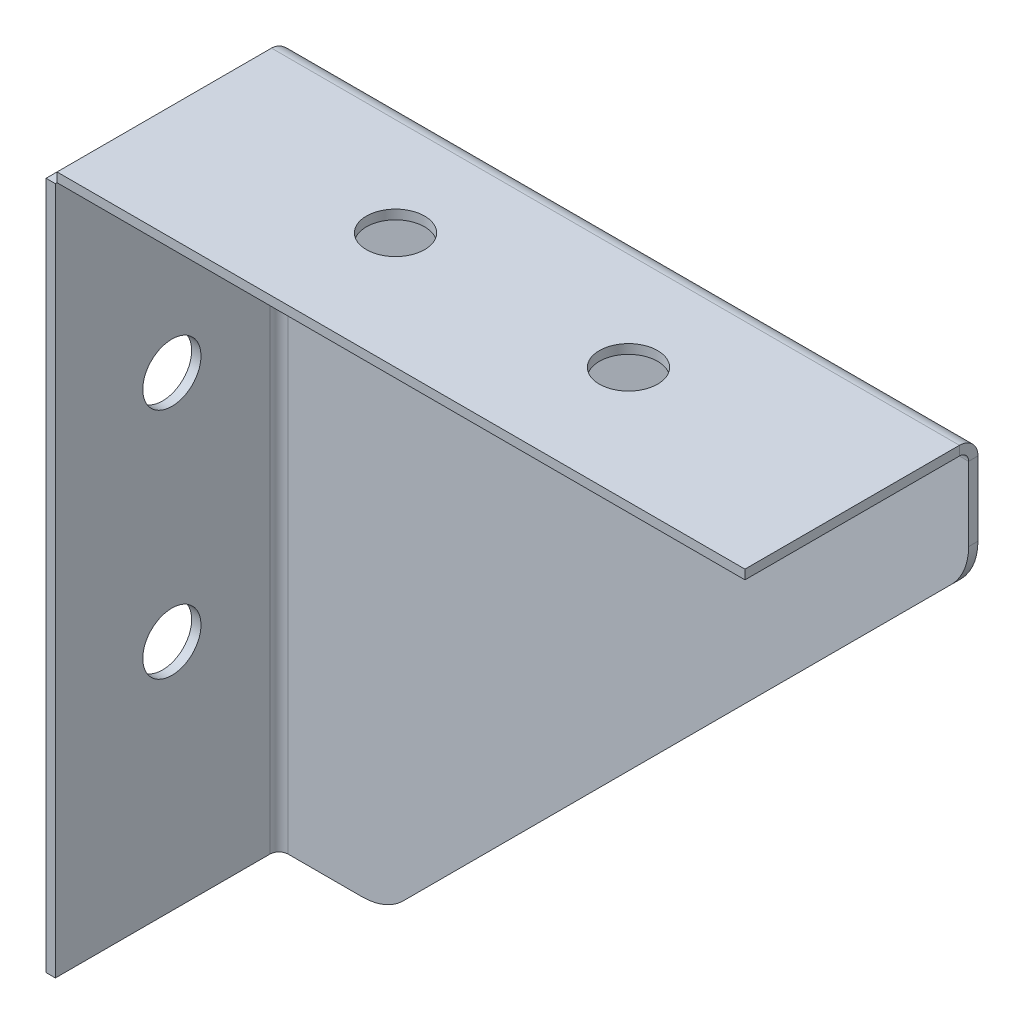
ISO-10303-21;
HEADER;
FILE_DESCRIPTION(('STEP AP214'),'2;1');
FILE_NAME('part.step','',(''),(''),'','','');
FILE_SCHEMA(('AUTOMOTIVE_DESIGN { 1 0 10303 214 1 1 1 1 }'));
ENDSEC;
DATA;
#1=APPLICATION_CONTEXT('core data for automotive mechanical design processes');
#2=APPLICATION_PROTOCOL_DEFINITION('international standard','automotive_design',2000,#1);
#3=PRODUCT_CONTEXT('',#1,'mechanical');
#4=PRODUCT('Part','Part','',(#3));
#5=PRODUCT_RELATED_PRODUCT_CATEGORY('part','',(#4));
#6=PRODUCT_DEFINITION_FORMATION('','',#4);
#7=PRODUCT_DEFINITION_CONTEXT('part definition',#1,'design');
#8=PRODUCT_DEFINITION('design','',#6,#7);
#9=PRODUCT_DEFINITION_SHAPE('','',#8);
#10=(LENGTH_UNIT() NAMED_UNIT(*) SI_UNIT(.MILLI.,.METRE.));
#11=(NAMED_UNIT(*) PLANE_ANGLE_UNIT() SI_UNIT($,.RADIAN.));
#12=(NAMED_UNIT(*) SI_UNIT($,.STERADIAN.) SOLID_ANGLE_UNIT());
#13=UNCERTAINTY_MEASURE_WITH_UNIT(LENGTH_MEASURE(1.E-05),#10,'distance_accuracy_value','');
#14=(GEOMETRIC_REPRESENTATION_CONTEXT(3) GLOBAL_UNCERTAINTY_ASSIGNED_CONTEXT((#13)) GLOBAL_UNIT_ASSIGNED_CONTEXT((#10,
#11,#12)) REPRESENTATION_CONTEXT('',''));
#15=CARTESIAN_POINT('',(0.,0.,0.));
#16=DIRECTION('',(0.,0.,1.));
#17=DIRECTION('',(1.,0.,0.));
#18=AXIS2_PLACEMENT_3D('',#15,#16,#17);
#19=CARTESIAN_POINT('',(12.7,-76.2,1.016));
#20=DIRECTION('',(0.,1.,0.));
#21=DIRECTION('',(0.,0.,1.));
#22=AXIS2_PLACEMENT_3D('',#19,#20,#21);
#23=PLANE('',#22);
#24=DIRECTION('',(1.,0.,0.));
#25=VECTOR('',#24,1.);
#26=CARTESIAN_POINT('',(12.7,-76.2,0.));
#27=LINE('',#26,#25);
#28=CARTESIAN_POINT('',(2.01599999999893,-76.1999999999716,0.));
#29=VERTEX_POINT('',#28);
#30=CARTESIAN_POINT('',(10.0697438789309,-76.2,0.));
#31=VERTEX_POINT('',#30);
#32=EDGE_CURVE('E272',#29,#31,#27,.T.);
#33=ORIENTED_EDGE('',*,*,#32,.T.);
#34=DIRECTION('',(0.,0.,-1.));
#35=VECTOR('',#34,1.);
#36=CARTESIAN_POINT('',(10.0697438789309,-76.2,1.016));
#37=LINE('',#36,#35);
#38=CARTESIAN_POINT('',(10.0697438789309,-76.2,1.016));
#39=VERTEX_POINT('',#38);
#40=EDGE_CURVE('E65',#31,#39,#37,.F.);
#41=ORIENTED_EDGE('',*,*,#40,.T.);
#42=DIRECTION('',(1.,0.,0.));
#43=VECTOR('',#42,1.);
#44=CARTESIAN_POINT('',(12.7,-76.2,1.016));
#45=LINE('',#44,#43);
#46=CARTESIAN_POINT('',(2.01599999999893,-76.1999999999716,1.016));
#47=VERTEX_POINT('',#46);
#48=EDGE_CURVE('E275',#47,#39,#45,.T.);
#49=ORIENTED_EDGE('',*,*,#48,.F.);
#50=DIRECTION('',(0.,0.,-1.));
#51=VECTOR('',#50,1.);
#52=CARTESIAN_POINT('',(2.01599999999893,-76.1999999999716,0.));
#53=LINE('',#52,#51);
#54=EDGE_CURVE('E202',#29,#47,#53,.F.);
#55=ORIENTED_EDGE('',*,*,#54,.F.);
#56=EDGE_LOOP('',(#33,#41,#49,#55));
#57=FACE_BOUND('',#56,.T.);
#58=ADVANCED_FACE('F41',(#57),#23,.F.);
#59=CARTESIAN_POINT('',(76.2,-12.7,1.016));
#60=DIRECTION('',(-0.707106781186548,0.707106781186548,0.));
#61=DIRECTION('',(-0.707106781186548,-0.707106781186548,0.));
#62=AXIS2_PLACEMENT_3D('',#59,#60,#61);
#63=PLANE('',#62);
#64=DIRECTION('',(0.707106781186548,0.707106781186548,0.));
#65=VECTOR('',#64,1.);
#66=CARTESIAN_POINT('',(76.2,-12.7,1.016));
#67=LINE('',#66,#65);
#68=CARTESIAN_POINT('',(14.5598719394654,-74.3401280605346,1.016));
#69=VERTEX_POINT('',#68);
#70=CARTESIAN_POINT('',(74.3401280605346,-14.5598719394654,1.016));
#71=VERTEX_POINT('',#70);
#72=EDGE_CURVE('E277',#69,#71,#67,.T.);
#73=ORIENTED_EDGE('',*,*,#72,.F.);
#74=DIRECTION('',(0.,0.,-1.));
#75=VECTOR('',#74,1.);
#76=CARTESIAN_POINT('',(14.5598719394654,-74.3401280605346,1.016));
#77=LINE('',#76,#75);
#78=CARTESIAN_POINT('',(14.5598719394654,-74.3401280605346,0.));
#79=VERTEX_POINT('',#78);
#80=EDGE_CURVE('E289',#69,#79,#77,.T.);
#81=ORIENTED_EDGE('',*,*,#80,.T.);
#82=DIRECTION('',(0.707106781186548,0.707106781186548,0.));
#83=VECTOR('',#82,1.);
#84=CARTESIAN_POINT('',(76.2,-12.7,0.));
#85=LINE('',#84,#83);
#86=CARTESIAN_POINT('',(74.3401280605346,-14.5598719394654,0.));
#87=VERTEX_POINT('',#86);
#88=EDGE_CURVE('E284',#79,#87,#85,.T.);
#89=ORIENTED_EDGE('',*,*,#88,.T.);
#90=DIRECTION('',(0.,0.,-1.));
#91=VECTOR('',#90,1.);
#92=CARTESIAN_POINT('',(74.3401280605346,-14.5598719394654,1.016));
#93=LINE('',#92,#91);
#94=EDGE_CURVE('E282',#87,#71,#93,.F.);
#95=ORIENTED_EDGE('',*,*,#94,.T.);
#96=EDGE_LOOP('',(#73,#81,#89,#95));
#97=FACE_BOUND('',#96,.T.);
#98=ADVANCED_FACE('F304',(#97),#63,.F.);
#99=CARTESIAN_POINT('',(76.2,0.,1.016));
#100=DIRECTION('',(-1.,0.,0.));
#101=DIRECTION('',(0.,0.,1.));
#102=AXIS2_PLACEMENT_3D('',#99,#100,#101);
#103=PLANE('',#102);
#104=DIRECTION('',(0.,1.,0.));
#105=VECTOR('',#104,1.);
#106=CARTESIAN_POINT('',(76.2,0.,1.016));
#107=LINE('',#106,#105);
#108=CARTESIAN_POINT('',(76.2,-10.0697438789308,1.016));
#109=VERTEX_POINT('',#108);
#110=CARTESIAN_POINT('',(76.2,-2.016,1.016));
#111=VERTEX_POINT('',#110);
#112=EDGE_CURVE('E280',#109,#111,#107,.T.);
#113=ORIENTED_EDGE('',*,*,#112,.F.);
#114=DIRECTION('',(0.,0.,-1.));
#115=VECTOR('',#114,1.);
#116=CARTESIAN_POINT('',(76.2,-10.0697438789308,1.016));
#117=LINE('',#116,#115);
#118=CARTESIAN_POINT('',(76.2,-10.0697438789308,0.));
#119=VERTEX_POINT('',#118);
#120=EDGE_CURVE('E11',#109,#119,#117,.T.);
#121=ORIENTED_EDGE('',*,*,#120,.T.);
#122=DIRECTION('',(0.,1.,0.));
#123=VECTOR('',#122,1.);
#124=CARTESIAN_POINT('',(76.2,0.,0.));
#125=LINE('',#124,#123);
#126=CARTESIAN_POINT('',(76.2,-2.016,0.));
#127=VERTEX_POINT('',#126);
#128=EDGE_CURVE('E278',#119,#127,#125,.T.);
#129=ORIENTED_EDGE('',*,*,#128,.T.);
#130=DIRECTION('',(0.,0.,-1.));
#131=VECTOR('',#130,1.);
#132=CARTESIAN_POINT('',(76.1999999999716,-2.016,0.));
#133=LINE('',#132,#131);
#134=EDGE_CURVE('E235',#127,#111,#133,.F.);
#135=ORIENTED_EDGE('',*,*,#134,.T.);
#136=EDGE_LOOP('',(#113,#121,#129,#135));
#137=FACE_BOUND('',#136,.T.);
#138=ADVANCED_FACE('F343',(#137),#103,.F.);
#139=CARTESIAN_POINT('',(0.,0.,1.016));
#140=DIRECTION('',(0.,0.,-1.));
#141=DIRECTION('',(-1.,0.,0.));
#142=AXIS2_PLACEMENT_3D('',#139,#140,#141);
#143=PLANE('',#142);
#144=ORIENTED_EDGE('',*,*,#48,.T.);
#145=CARTESIAN_POINT('',(10.0697438789309,-69.85,1.016));
#146=DIRECTION('',(0.,0.,-1.));
#147=DIRECTION('',(-1.,0.,0.));
#148=AXIS2_PLACEMENT_3D('',#145,#146,#147);
#149=CIRCLE('',#148,6.35);
#150=EDGE_CURVE('E50',#39,#69,#149,.F.);
#151=ORIENTED_EDGE('',*,*,#150,.T.);
#152=ORIENTED_EDGE('',*,*,#72,.T.);
#153=CARTESIAN_POINT('',(69.85,-10.0697438789308,1.016));
#154=DIRECTION('',(0.,0.,-1.));
#155=DIRECTION('',(-1.,0.,0.));
#156=AXIS2_PLACEMENT_3D('',#153,#154,#155);
#157=CIRCLE('',#156,6.35);
#158=EDGE_CURVE('E57',#71,#109,#157,.F.);
#159=ORIENTED_EDGE('',*,*,#158,.T.);
#160=ORIENTED_EDGE('',*,*,#112,.T.);
#161=DIRECTION('',(-1.,0.,0.));
#162=VECTOR('',#161,1.);
#163=CARTESIAN_POINT('',(457.2,-2.016,1.016));
#164=LINE('',#163,#162);
#165=CARTESIAN_POINT('',(2.016,-2.016,1.016));
#166=VERTEX_POINT('',#165);
#167=EDGE_CURVE('E218',#111,#166,#164,.T.);
#168=ORIENTED_EDGE('',*,*,#167,.T.);
#169=DIRECTION('',(0.,-1.,0.));
#170=VECTOR('',#169,1.);
#171=CARTESIAN_POINT('',(2.016,0.,1.016));
#172=LINE('',#171,#170);
#173=EDGE_CURVE('E205',#166,#47,#172,.T.);
#174=ORIENTED_EDGE('',*,*,#173,.T.);
#175=EDGE_LOOP('',(#144,#151,#152,#159,#160,#168,#174));
#176=FACE_BOUND('',#175,.T.);
#177=ADVANCED_FACE('F300',(#176),#143,.F.);
#178=CARTESIAN_POINT('',(0.,0.,0.));
#179=DIRECTION('',(0.,0.,-1.));
#180=DIRECTION('',(-1.,0.,0.));
#181=AXIS2_PLACEMENT_3D('',#178,#179,#180);
#182=PLANE('',#181);
#183=ORIENTED_EDGE('',*,*,#88,.F.);
#184=CARTESIAN_POINT('',(10.0697438789309,-69.85,0.));
#185=DIRECTION('',(0.,0.,-1.));
#186=DIRECTION('',(-1.,0.,0.));
#187=AXIS2_PLACEMENT_3D('',#184,#185,#186);
#188=CIRCLE('',#187,6.35);
#189=EDGE_CURVE('E294',#79,#31,#188,.T.);
#190=ORIENTED_EDGE('',*,*,#189,.T.);
#191=ORIENTED_EDGE('',*,*,#32,.F.);
#192=DIRECTION('',(0.,-1.,0.));
#193=VECTOR('',#192,1.);
#194=CARTESIAN_POINT('',(2.016,0.,0.));
#195=LINE('',#194,#193);
#196=CARTESIAN_POINT('',(2.01599999999997,-2.01599999998326,0.));
#197=VERTEX_POINT('',#196);
#198=EDGE_CURVE('E197',#197,#29,#195,.T.);
#199=ORIENTED_EDGE('',*,*,#198,.F.);
#200=DIRECTION('',(-1.,0.,0.));
#201=VECTOR('',#200,1.);
#202=CARTESIAN_POINT('',(457.2,-2.016,0.));
#203=LINE('',#202,#201);
#204=EDGE_CURVE('E211',#127,#197,#203,.T.);
#205=ORIENTED_EDGE('',*,*,#204,.F.);
#206=ORIENTED_EDGE('',*,*,#128,.F.);
#207=CARTESIAN_POINT('',(69.85,-10.0697438789308,0.));
#208=DIRECTION('',(0.,0.,-1.));
#209=DIRECTION('',(-1.,0.,0.));
#210=AXIS2_PLACEMENT_3D('',#207,#208,#209);
#211=CIRCLE('',#210,6.35);
#212=EDGE_CURVE('E292',#119,#87,#211,.T.);
#213=ORIENTED_EDGE('',*,*,#212,.T.);
#214=EDGE_LOOP('',(#183,#190,#191,#199,#205,#206,#213));
#215=FACE_BOUND('',#214,.T.);
#216=ADVANCED_FACE('F310',(#215),#182,.T.);
#217=CARTESIAN_POINT('',(76.2,0.,25.4));
#218=DIRECTION('',(0.,0.,1.));
#219=DIRECTION('',(1.,0.,0.));
#220=AXIS2_PLACEMENT_3D('',#217,#218,#219);
#221=PLANE('',#220);
#222=DIRECTION('',(0.,1.,0.));
#223=VECTOR('',#222,1.);
#224=CARTESIAN_POINT('',(1.19560512240656,0.,25.4));
#225=LINE('',#224,#223);
#226=CARTESIAN_POINT('',(1.19560512240656,0.,25.4));
#227=VERTEX_POINT('',#226);
#228=CARTESIAN_POINT('',(1.19560512240656,-1.016,25.4));
#229=VERTEX_POINT('',#228);
#230=EDGE_CURVE('E269',#227,#229,#225,.F.);
#231=ORIENTED_EDGE('',*,*,#230,.T.);
#232=DIRECTION('',(1.,0.,0.));
#233=VECTOR('',#232,1.);
#234=CARTESIAN_POINT('',(76.2,-1.016,25.4));
#235=LINE('',#234,#233);
#236=CARTESIAN_POINT('',(76.2,-1.016,25.4));
#237=VERTEX_POINT('',#236);
#238=EDGE_CURVE('E248',#237,#229,#235,.F.);
#239=ORIENTED_EDGE('',*,*,#238,.F.);
#240=DIRECTION('',(0.,1.,0.));
#241=VECTOR('',#240,1.);
#242=CARTESIAN_POINT('',(76.2,0.,25.4));
#243=LINE('',#242,#241);
#244=CARTESIAN_POINT('',(76.2,0.,25.4));
#245=VERTEX_POINT('',#244);
#246=EDGE_CURVE('E266',#245,#237,#243,.F.);
#247=ORIENTED_EDGE('',*,*,#246,.F.);
#248=DIRECTION('',(1.,0.,0.));
#249=VECTOR('',#248,1.);
#250=CARTESIAN_POINT('',(76.2,0.,25.4));
#251=LINE('',#250,#249);
#252=EDGE_CURVE('E238',#245,#227,#251,.F.);
#253=ORIENTED_EDGE('',*,*,#252,.T.);
#254=EDGE_LOOP('',(#231,#239,#247,#253));
#255=FACE_BOUND('',#254,.T.);
#256=ADVANCED_FACE('F363',(#255),#221,.T.);
#257=CARTESIAN_POINT('',(76.2,0.,25.4));
#258=DIRECTION('',(-1.,0.,0.));
#259=DIRECTION('',(0.,0.,1.));
#260=AXIS2_PLACEMENT_3D('',#257,#258,#259);
#261=PLANE('',#260);
#262=ORIENTED_EDGE('',*,*,#246,.T.);
#263=DIRECTION('',(0.,0.,1.));
#264=VECTOR('',#263,1.);
#265=CARTESIAN_POINT('',(76.2,-1.016,25.4));
#266=LINE('',#265,#264);
#267=CARTESIAN_POINT('',(76.1999999999716,-1.016,2.016));
#268=VERTEX_POINT('',#267);
#269=EDGE_CURVE('E245',#237,#268,#266,.F.);
#270=ORIENTED_EDGE('',*,*,#269,.T.);
#271=DIRECTION('',(0.,1.,0.));
#272=VECTOR('',#271,1.);
#273=CARTESIAN_POINT('',(76.2,0.,2.016));
#274=LINE('',#273,#272);
#275=CARTESIAN_POINT('',(76.1999999999716,0.,2.016));
#276=VERTEX_POINT('',#275);
#277=EDGE_CURVE('E263',#276,#268,#274,.F.);
#278=ORIENTED_EDGE('',*,*,#277,.F.);
#279=DIRECTION('',(0.,0.,1.));
#280=VECTOR('',#279,1.);
#281=CARTESIAN_POINT('',(76.2,0.,25.4));
#282=LINE('',#281,#280);
#283=EDGE_CURVE('E257',#245,#276,#282,.F.);
#284=ORIENTED_EDGE('',*,*,#283,.F.);
#285=EDGE_LOOP('',(#262,#270,#278,#284));
#286=FACE_BOUND('',#285,.T.);
#287=ADVANCED_FACE('F361',(#286),#261,.F.);
#288=CARTESIAN_POINT('',(1.19560512240656,0.,25.4));
#289=DIRECTION('',(-1.,0.,0.));
#290=DIRECTION('',(0.,0.,1.));
#291=AXIS2_PLACEMENT_3D('',#288,#289,#290);
#292=PLANE('',#291);
#293=DIRECTION('',(0.,0.,1.));
#294=VECTOR('',#293,1.);
#295=CARTESIAN_POINT('',(1.19560512240656,0.,25.4));
#296=LINE('',#295,#294);
#297=CARTESIAN_POINT('',(1.19560512240656,0.,2.016));
#298=VERTEX_POINT('',#297);
#299=EDGE_CURVE('E251',#298,#227,#296,.T.);
#300=ORIENTED_EDGE('',*,*,#299,.F.);
#301=DIRECTION('',(0.,1.,0.));
#302=VECTOR('',#301,1.);
#303=CARTESIAN_POINT('',(1.19560512240656,0.,2.016));
#304=LINE('',#303,#302);
#305=CARTESIAN_POINT('',(1.19560512240469,-1.016,2.016));
#306=VERTEX_POINT('',#305);
#307=EDGE_CURVE('E253',#298,#306,#304,.F.);
#308=ORIENTED_EDGE('',*,*,#307,.T.);
#309=DIRECTION('',(0.,0.,1.));
#310=VECTOR('',#309,1.);
#311=CARTESIAN_POINT('',(1.19560512240656,-1.016,25.4));
#312=LINE('',#311,#310);
#313=EDGE_CURVE('E244',#306,#229,#312,.T.);
#314=ORIENTED_EDGE('',*,*,#313,.T.);
#315=ORIENTED_EDGE('',*,*,#230,.F.);
#316=EDGE_LOOP('',(#300,#308,#314,#315));
#317=FACE_BOUND('',#316,.T.);
#318=ADVANCED_FACE('F354',(#317),#292,.T.);
#319=CARTESIAN_POINT('',(76.2,-1.016,25.4));
#320=DIRECTION('',(0.,1.,0.));
#321=DIRECTION('',(0.,0.,1.));
#322=AXIS2_PLACEMENT_3D('',#319,#320,#321);
#323=PLANE('',#322);
#324=CARTESIAN_POINT('',(25.3999999999946,-1.016,12.7));
#325=DIRECTION('',(0.,1.,0.));
#326=DIRECTION('',(0.,0.,1.));
#327=AXIS2_PLACEMENT_3D('',#324,#325,#326);
#328=CIRCLE('',#327,3.17499999999999);
#329=CARTESIAN_POINT('',(25.3999999999946,-1.016,15.875));
#330=VERTEX_POINT('',#329);
#331=EDGE_CURVE('E45',#330,#330,#328,.T.);
#332=ORIENTED_EDGE('',*,*,#331,.T.);
#333=EDGE_LOOP('',(#332));
#334=FACE_BOUND('',#333,.T.);
#335=CARTESIAN_POINT('',(50.8000000000088,-1.016,12.7));
#336=DIRECTION('',(0.,1.,0.));
#337=DIRECTION('',(0.,0.,1.));
#338=AXIS2_PLACEMENT_3D('',#335,#336,#337);
#339=CIRCLE('',#338,3.17499999999999);
#340=CARTESIAN_POINT('',(50.8000000000088,-1.016,15.875));
#341=VERTEX_POINT('',#340);
#342=EDGE_CURVE('E183',#341,#341,#339,.T.);
#343=ORIENTED_EDGE('',*,*,#342,.T.);
#344=EDGE_LOOP('',(#343));
#345=FACE_BOUND('',#344,.T.);
#346=DIRECTION('',(1.,0.,0.));
#347=VECTOR('',#346,1.);
#348=CARTESIAN_POINT('',(76.2,-1.016,2.016));
#349=LINE('',#348,#347);
#350=EDGE_CURVE('E241',#268,#306,#349,.F.);
#351=ORIENTED_EDGE('',*,*,#350,.F.);
#352=ORIENTED_EDGE('',*,*,#269,.F.);
#353=ORIENTED_EDGE('',*,*,#238,.T.);
#354=ORIENTED_EDGE('',*,*,#313,.F.);
#355=EDGE_LOOP('',(#351,#352,#353,#354));
#356=FACE_BOUND('',#355,.T.);
#357=ADVANCED_FACE('F350',(#334,#345,#356),#323,.F.);
#358=CARTESIAN_POINT('',(76.2,0.,25.4));
#359=DIRECTION('',(0.,1.,0.));
#360=DIRECTION('',(0.,0.,1.));
#361=AXIS2_PLACEMENT_3D('',#358,#359,#360);
#362=PLANE('',#361);
#363=CARTESIAN_POINT('',(25.3999999999946,0.,12.7));
#364=DIRECTION('',(0.,1.,0.));
#365=DIRECTION('',(0.,0.,1.));
#366=AXIS2_PLACEMENT_3D('',#363,#364,#365);
#367=CIRCLE('',#366,3.17499999999999);
#368=CARTESIAN_POINT('',(25.3999999999946,0.,15.875));
#369=VERTEX_POINT('',#368);
#370=EDGE_CURVE('E424',#369,#369,#367,.T.);
#371=ORIENTED_EDGE('',*,*,#370,.F.);
#372=EDGE_LOOP('',(#371));
#373=FACE_BOUND('',#372,.T.);
#374=CARTESIAN_POINT('',(50.8000000000088,0.,12.7));
#375=DIRECTION('',(0.,1.,0.));
#376=DIRECTION('',(0.,0.,1.));
#377=AXIS2_PLACEMENT_3D('',#374,#375,#376);
#378=CIRCLE('',#377,3.17499999999999);
#379=CARTESIAN_POINT('',(50.8000000000088,0.,15.875));
#380=VERTEX_POINT('',#379);
#381=EDGE_CURVE('E427',#380,#380,#378,.T.);
#382=ORIENTED_EDGE('',*,*,#381,.F.);
#383=EDGE_LOOP('',(#382));
#384=FACE_BOUND('',#383,.T.);
#385=DIRECTION('',(1.,0.,0.));
#386=VECTOR('',#385,1.);
#387=CARTESIAN_POINT('',(76.2,0.,2.016));
#388=LINE('',#387,#386);
#389=EDGE_CURVE('E254',#276,#298,#388,.F.);
#390=ORIENTED_EDGE('',*,*,#389,.T.);
#391=ORIENTED_EDGE('',*,*,#299,.T.);
#392=ORIENTED_EDGE('',*,*,#252,.F.);
#393=ORIENTED_EDGE('',*,*,#283,.T.);
#394=EDGE_LOOP('',(#390,#391,#392,#393));
#395=FACE_BOUND('',#394,.T.);
#396=ADVANCED_FACE('F357',(#373,#384,#395),#362,.T.);
#397=CARTESIAN_POINT('',(76.1999999999716,-2.016,2.016));
#398=DIRECTION('',(-1.,1.40773503964908E-11,0.));
#399=DIRECTION('',(-1.40773503964908E-11,-1.,0.));
#400=AXIS2_PLACEMENT_3D('',#397,#398,#399);
#401=PLANE('',#400);
#402=ORIENTED_EDGE('',*,*,#277,.T.);
#403=CARTESIAN_POINT('',(76.1999999999716,-2.016,2.016));
#404=DIRECTION('',(1.,-1.40773503964908E-11,0.));
#405=DIRECTION('',(1.40773503964908E-11,1.,0.));
#406=AXIS2_PLACEMENT_3D('',#403,#404,#405);
#407=CIRCLE('',#406,1.);
#408=EDGE_CURVE('E221',#268,#111,#407,.F.);
#409=ORIENTED_EDGE('',*,*,#408,.T.);
#410=ORIENTED_EDGE('',*,*,#134,.F.);
#411=CARTESIAN_POINT('',(76.1999999999716,-2.016,2.016));
#412=DIRECTION('',(1.,-1.40773503964908E-11,0.));
#413=DIRECTION('',(1.40773503964908E-11,1.,0.));
#414=AXIS2_PLACEMENT_3D('',#411,#412,#413);
#415=CIRCLE('',#414,2.016);
#416=EDGE_CURVE('E230',#276,#127,#415,.F.);
#417=ORIENTED_EDGE('',*,*,#416,.F.);
#418=EDGE_LOOP('',(#402,#409,#410,#417));
#419=FACE_BOUND('',#418,.T.);
#420=ADVANCED_FACE('F341',(#419),#401,.F.);
#421=CARTESIAN_POINT('',(1.19560512240469,0.,2.016));
#422=CARTESIAN_POINT('',(1.19560512240469,-0.338666666666667,2.016));
#423=CARTESIAN_POINT('',(1.19560512240469,-0.677333333333333,2.016));
#424=CARTESIAN_POINT('',(1.19560512240469,-1.016,2.016));
#425=CARTESIAN_POINT('',(1.19560512240469,0.,6.048));
#426=CARTESIAN_POINT('',(1.19560512240469,-0.338666666666667,5.37066666666667));
#427=CARTESIAN_POINT('',(1.19560512240469,-0.677333333333333,4.69333333333334));
#428=CARTESIAN_POINT('',(1.19560512240469,-1.016,4.016));
#429=CARTESIAN_POINT('',(2.83639487759157,-4.032,6.048));
#430=CARTESIAN_POINT('',(2.83639487759157,-3.69333333333334,5.37066666666667));
#431=CARTESIAN_POINT('',(2.83639487759157,-3.35466666666667,4.69333333333334));
#432=CARTESIAN_POINT('',(2.83639487759157,-3.016,4.016));
#433=CARTESIAN_POINT('',(2.83639487759157,-4.032,2.016));
#434=CARTESIAN_POINT('',(2.83639487759157,-3.69333333333333,2.016));
#435=CARTESIAN_POINT('',(2.83639487759157,-3.35466666666667,2.016));
#436=CARTESIAN_POINT('',(2.83639487759157,-3.016,2.016));
#437=CARTESIAN_POINT('',(2.83639487759157,-4.032,-2.016));
#438=CARTESIAN_POINT('',(2.83639487759157,-3.69333333333333,-1.33866666666667));
#439=CARTESIAN_POINT('',(2.83639487759157,-3.35466666666667,-0.661333333333333));
#440=CARTESIAN_POINT('',(2.83639487759157,-3.016,0.0160000000000008));
#441=CARTESIAN_POINT('',(1.19560512240469,0.,-2.016));
#442=CARTESIAN_POINT('',(1.19560512240469,-0.338666666666667,-1.33866666666667));
#443=CARTESIAN_POINT('',(1.19560512240469,-0.677333333333333,-0.661333333333333));
#444=CARTESIAN_POINT('',(1.19560512240469,-1.016,0.0160000000000008));
#445=CARTESIAN_POINT('',(1.19560512240469,0.,2.016));
#446=CARTESIAN_POINT('',(1.19560512240469,-0.338666666666667,2.016));
#447=CARTESIAN_POINT('',(1.19560512240469,-0.677333333333333,2.016));
#448=CARTESIAN_POINT('',(1.19560512240469,-1.016,2.016));
#449=(BOUNDED_SURFACE() B_SPLINE_SURFACE(3,3,((#421,#422,#423,#424),(#425,#426,#427,#428),(#429,
#430,#431,#432),(#433,#434,#435,#436),(#437,#438,#439,#440),(#441,#442,#443,#444),(#445,#446,
#447,#448)),.UNSPECIFIED.,.T.,.F.,.F.) B_SPLINE_SURFACE_WITH_KNOTS((4,3,4),(4,4),(0.,0.5,1.),
(0.,1.),.UNSPECIFIED.) GEOMETRIC_REPRESENTATION_ITEM() RATIONAL_B_SPLINE_SURFACE(((1.,1.,1.,1.),
(0.333333333333333,0.333333333333333,0.333333333333333,0.333333333333333),(0.333333333333333,
0.333333333333333,0.333333333333333,0.333333333333333),(1.,1.,1.,1.),(0.333333333333333,
0.333333333333333,0.333333333333333,0.333333333333333),(0.333333333333333,0.333333333333333,
0.333333333333333,0.333333333333333),(1.,1.,1.,1.))) REPRESENTATION_ITEM('') SURFACE());
#450=CARTESIAN_POINT('',(2.01599999999813,-2.016,2.016));
#451=DIRECTION('',(-0.92624294168685,-0.376927065856633,0.));
#452=DIRECTION('',(-0.376927065856633,0.92624294168685,0.));
#453=AXIS2_PLACEMENT_3D('',#450,#451,#452);
#454=ELLIPSE('',#453,2.1765348044958,2.016);
#455=EDGE_CURVE('E222',#197,#298,#454,.F.);
#456=DIRECTION('',(0.,0.,-1.));
#457=VECTOR('',#456,1.);
#458=CARTESIAN_POINT('',(2.01599999999813,-2.016,0.));
#459=LINE('',#458,#457);
#460=EDGE_CURVE('E227',#197,#166,#459,.F.);
#461=CARTESIAN_POINT('',(2.01599999999813,-2.016,2.016));
#462=DIRECTION('',(-0.773118082662841,-0.634262114791458,0.));
#463=DIRECTION('',(-0.634262114791458,0.773118082662841,0.));
#464=AXIS2_PLACEMENT_3D('',#461,#462,#463);
#465=ELLIPSE('',#464,1.29346347268934,1.);
#466=EDGE_CURVE('E225',#166,#306,#465,.F.);
#467=ORIENTED_EDGE('',*,*,#455,.F.);
#468=ORIENTED_EDGE('',*,*,#460,.T.);
#469=ORIENTED_EDGE('',*,*,#466,.T.);
#470=ORIENTED_EDGE('',*,*,#307,.F.);
#471=EDGE_LOOP('',(#467,#468,#469,#470));
#472=FACE_BOUND('',#471,.T.);
#473=ADVANCED_FACE('F334',(#472),#449,.F.);
#474=CARTESIAN_POINT('',(457.2,-2.016,2.016));
#475=DIRECTION('',(-1.,0.,0.));
#476=DIRECTION('',(0.,0.,1.));
#477=AXIS2_PLACEMENT_3D('',#474,#475,#476);
#478=CYLINDRICAL_SURFACE('',#477,1.);
#479=ORIENTED_EDGE('',*,*,#167,.F.);
#480=ORIENTED_EDGE('',*,*,#408,.F.);
#481=ORIENTED_EDGE('',*,*,#350,.T.);
#482=ORIENTED_EDGE('',*,*,#466,.F.);
#483=EDGE_LOOP('',(#479,#480,#481,#482));
#484=FACE_BOUND('',#483,.T.);
#485=ADVANCED_FACE('F346',(#484),#478,.F.);
#486=CARTESIAN_POINT('',(457.2,-2.016,2.016));
#487=DIRECTION('',(-1.,0.,0.));
#488=DIRECTION('',(0.,0.,1.));
#489=AXIS2_PLACEMENT_3D('',#486,#487,#488);
#490=CYLINDRICAL_SURFACE('',#489,2.016);
#491=ORIENTED_EDGE('',*,*,#204,.T.);
#492=ORIENTED_EDGE('',*,*,#455,.T.);
#493=ORIENTED_EDGE('',*,*,#389,.F.);
#494=ORIENTED_EDGE('',*,*,#416,.T.);
#495=EDGE_LOOP('',(#491,#492,#493,#494));
#496=FACE_BOUND('',#495,.T.);
#497=ADVANCED_FACE('F338',(#496),#490,.T.);
#498=CARTESIAN_POINT('',(-6.41321649830483E-12,-76.2,25.4));
#499=DIRECTION('',(0.,-1.,0.));
#500=DIRECTION('',(0.,0.,1.));
#501=AXIS2_PLACEMENT_3D('',#498,#499,#500);
#502=PLANE('',#501);
#503=DIRECTION('',(-1.,0.,0.));
#504=VECTOR('',#503,1.);
#505=CARTESIAN_POINT('',(-6.41321649830483E-12,-76.2,2.016));
#506=LINE('',#505,#504);
#507=CARTESIAN_POINT('',(-6.41321649830483E-12,-76.2,2.016));
#508=VERTEX_POINT('',#507);
#509=CARTESIAN_POINT('',(1.01599999999893,-76.1999999999716,2.016));
#510=VERTEX_POINT('',#509);
#511=EDGE_CURVE('E187',#508,#510,#506,.F.);
#512=ORIENTED_EDGE('',*,*,#511,.T.);
#513=DIRECTION('',(0.,0.,1.));
#514=VECTOR('',#513,1.);
#515=CARTESIAN_POINT('',(1.01599999999359,-76.2,25.4));
#516=LINE('',#515,#514);
#517=CARTESIAN_POINT('',(1.01599999999359,-76.2,25.4));
#518=VERTEX_POINT('',#517);
#519=EDGE_CURVE('E190',#510,#518,#516,.T.);
#520=ORIENTED_EDGE('',*,*,#519,.T.);
#521=DIRECTION('',(-1.,0.,0.));
#522=VECTOR('',#521,1.);
#523=CARTESIAN_POINT('',(-6.41321649830483E-12,-76.2,25.4));
#524=LINE('',#523,#522);
#525=CARTESIAN_POINT('',(-6.41321649830483E-12,-76.2,25.4));
#526=VERTEX_POINT('',#525);
#527=EDGE_CURVE('E175',#526,#518,#524,.F.);
#528=ORIENTED_EDGE('',*,*,#527,.F.);
#529=DIRECTION('',(0.,0.,1.));
#530=VECTOR('',#529,1.);
#531=CARTESIAN_POINT('',(-6.41321649830483E-12,-76.2,25.4));
#532=LINE('',#531,#530);
#533=EDGE_CURVE('E171',#508,#526,#532,.T.);
#534=ORIENTED_EDGE('',*,*,#533,.F.);
#535=EDGE_LOOP('',(#512,#520,#528,#534));
#536=FACE_BOUND('',#535,.T.);
#537=ADVANCED_FACE('F325',(#536),#502,.T.);
#538=CARTESIAN_POINT('',(0.,381.,25.4));
#539=DIRECTION('',(0.,0.,1.));
#540=DIRECTION('',(0.,1.,0.));
#541=AXIS2_PLACEMENT_3D('',#538,#539,#540);
#542=PLANE('',#541);
#543=ORIENTED_EDGE('',*,*,#527,.T.);
#544=DIRECTION('',(0.,1.,0.));
#545=VECTOR('',#544,1.);
#546=CARTESIAN_POINT('',(1.016,381.,25.4));
#547=LINE('',#546,#545);
#548=CARTESIAN_POINT('',(1.01599999999464,-1.19560512238132,25.4));
#549=VERTEX_POINT('',#548);
#550=EDGE_CURVE('E165',#549,#518,#547,.F.);
#551=ORIENTED_EDGE('',*,*,#550,.F.);
#552=DIRECTION('',(-1.,0.,0.));
#553=VECTOR('',#552,1.);
#554=CARTESIAN_POINT('',(-5.36111802351368E-12,-1.19560512238132,25.4));
#555=LINE('',#554,#553);
#556=CARTESIAN_POINT('',(-5.36111802351368E-12,-1.19560512238132,25.4));
#557=VERTEX_POINT('',#556);
#558=EDGE_CURVE('E158',#557,#549,#555,.F.);
#559=ORIENTED_EDGE('',*,*,#558,.F.);
#560=DIRECTION('',(0.,1.,0.));
#561=VECTOR('',#560,1.);
#562=CARTESIAN_POINT('',(0.,381.,25.4));
#563=LINE('',#562,#561);
#564=EDGE_CURVE('E168',#557,#526,#563,.F.);
#565=ORIENTED_EDGE('',*,*,#564,.T.);
#566=EDGE_LOOP('',(#543,#551,#559,#565));
#567=FACE_BOUND('',#566,.T.);
#568=ADVANCED_FACE('F177',(#567),#542,.T.);
#569=CARTESIAN_POINT('',(-5.36111802351368E-12,-1.19560512238132,25.4));
#570=DIRECTION('',(0.,-1.,0.));
#571=DIRECTION('',(0.,0.,1.));
#572=AXIS2_PLACEMENT_3D('',#569,#570,#571);
#573=PLANE('',#572);
#574=DIRECTION('',(0.,0.,1.));
#575=VECTOR('',#574,1.);
#576=CARTESIAN_POINT('',(-5.36111802351368E-12,-1.19560512238132,25.4));
#577=LINE('',#576,#575);
#578=CARTESIAN_POINT('',(0.,-1.19560512236677,2.016));
#579=VERTEX_POINT('',#578);
#580=EDGE_CURVE('E153',#557,#579,#577,.F.);
#581=ORIENTED_EDGE('',*,*,#580,.F.);
#582=ORIENTED_EDGE('',*,*,#558,.T.);
#583=DIRECTION('',(0.,0.,1.));
#584=VECTOR('',#583,1.);
#585=CARTESIAN_POINT('',(1.01599999999464,-1.19560512238132,25.4));
#586=LINE('',#585,#584);
#587=CARTESIAN_POINT('',(1.01599999999998,-1.19560512236678,2.016));
#588=VERTEX_POINT('',#587);
#589=EDGE_CURVE('E178',#549,#588,#586,.F.);
#590=ORIENTED_EDGE('',*,*,#589,.T.);
#591=DIRECTION('',(-1.,0.,0.));
#592=VECTOR('',#591,1.);
#593=CARTESIAN_POINT('',(-5.36111802351368E-12,-1.19560512238132,2.016));
#594=LINE('',#593,#592);
#595=EDGE_CURVE('E161',#579,#588,#594,.F.);
#596=ORIENTED_EDGE('',*,*,#595,.F.);
#597=EDGE_LOOP('',(#581,#582,#590,#596));
#598=FACE_BOUND('',#597,.T.);
#599=ADVANCED_FACE('F155',(#598),#573,.F.);
#600=CARTESIAN_POINT('',(1.016,381.,25.4));
#601=DIRECTION('',(-1.,0.,0.));
#602=DIRECTION('',(0.,0.,1.));
#603=AXIS2_PLACEMENT_3D('',#600,#601,#602);
#604=PLANE('',#603);
#605=CARTESIAN_POINT('',(1.01599999999394,-50.8,12.7));
#606=DIRECTION('',(-1.,0.,0.));
#607=DIRECTION('',(0.,-1.,0.));
#608=AXIS2_PLACEMENT_3D('',#605,#606,#607);
#609=CIRCLE('',#608,3.17499999999999);
#610=CARTESIAN_POINT('',(1.0159999999939,-53.975,12.7));
#611=VERTEX_POINT('',#610);
#612=EDGE_CURVE('E439',#611,#611,#609,.T.);
#613=ORIENTED_EDGE('',*,*,#612,.T.);
#614=EDGE_LOOP('',(#613));
#615=FACE_BOUND('',#614,.T.);
#616=CARTESIAN_POINT('',(1.0159999999943,-25.4,12.7));
#617=DIRECTION('',(-1.,0.,0.));
#618=DIRECTION('',(0.,-1.,0.));
#619=AXIS2_PLACEMENT_3D('',#616,#617,#618);
#620=CIRCLE('',#619,3.17499999999999);
#621=CARTESIAN_POINT('',(1.01599999999425,-28.575,12.7));
#622=VERTEX_POINT('',#621);
#623=EDGE_CURVE('E433',#622,#622,#620,.T.);
#624=ORIENTED_EDGE('',*,*,#623,.T.);
#625=EDGE_LOOP('',(#624));
#626=FACE_BOUND('',#625,.T.);
#627=ORIENTED_EDGE('',*,*,#550,.T.);
#628=ORIENTED_EDGE('',*,*,#519,.F.);
#629=DIRECTION('',(0.,1.,0.));
#630=VECTOR('',#629,1.);
#631=CARTESIAN_POINT('',(1.016,381.,2.016));
#632=LINE('',#631,#630);
#633=EDGE_CURVE('E194',#588,#510,#632,.F.);
#634=ORIENTED_EDGE('',*,*,#633,.F.);
#635=ORIENTED_EDGE('',*,*,#589,.F.);
#636=EDGE_LOOP('',(#627,#628,#634,#635));
#637=FACE_BOUND('',#636,.T.);
#638=ADVANCED_FACE('F323',(#615,#626,#637),#604,.F.);
#639=CARTESIAN_POINT('',(0.,381.,25.4));
#640=DIRECTION('',(-1.,0.,0.));
#641=DIRECTION('',(0.,0.,1.));
#642=AXIS2_PLACEMENT_3D('',#639,#640,#641);
#643=PLANE('',#642);
#644=CARTESIAN_POINT('',(-5.72715558768166E-11,-50.8,12.7));
#645=DIRECTION('',(-1.,0.,0.));
#646=DIRECTION('',(0.,0.,1.));
#647=AXIS2_PLACEMENT_3D('',#644,#645,#646);
#648=CIRCLE('',#647,3.17499999999999);
#649=CARTESIAN_POINT('',(-5.72715558768166E-11,-50.8,15.875));
#650=VERTEX_POINT('',#649);
#651=EDGE_CURVE('E442',#650,#650,#648,.T.);
#652=ORIENTED_EDGE('',*,*,#651,.F.);
#653=EDGE_LOOP('',(#652));
#654=FACE_BOUND('',#653,.T.);
#655=CARTESIAN_POINT('',(-5.69152659172585E-11,-25.4,12.7));
#656=DIRECTION('',(-1.,0.,0.));
#657=DIRECTION('',(0.,0.,1.));
#658=AXIS2_PLACEMENT_3D('',#655,#656,#657);
#659=CIRCLE('',#658,3.17499999999999);
#660=CARTESIAN_POINT('',(-5.69152659172585E-11,-25.4,15.875));
#661=VERTEX_POINT('',#660);
#662=EDGE_CURVE('E436',#661,#661,#659,.T.);
#663=ORIENTED_EDGE('',*,*,#662,.F.);
#664=EDGE_LOOP('',(#663));
#665=FACE_BOUND('',#664,.T.);
#666=ORIENTED_EDGE('',*,*,#564,.F.);
#667=ORIENTED_EDGE('',*,*,#580,.T.);
#668=DIRECTION('',(0.,1.,0.));
#669=VECTOR('',#668,1.);
#670=CARTESIAN_POINT('',(0.,381.,2.016));
#671=LINE('',#670,#669);
#672=EDGE_CURVE('E164',#579,#508,#671,.F.);
#673=ORIENTED_EDGE('',*,*,#672,.T.);
#674=ORIENTED_EDGE('',*,*,#533,.T.);
#675=EDGE_LOOP('',(#666,#667,#673,#674));
#676=FACE_BOUND('',#675,.T.);
#677=ADVANCED_FACE('F169',(#654,#665,#676),#643,.T.);
#678=CARTESIAN_POINT('',(4.03199999999996,-2.83639487759976,2.016));
#679=CARTESIAN_POINT('',(3.69333333333329,-2.83639487759976,2.016));
#680=CARTESIAN_POINT('',(3.35466666666663,-2.83639487759975,2.016));
#681=CARTESIAN_POINT('',(3.01599999999996,-2.83639487759975,2.016));
#682=CARTESIAN_POINT('',(4.03199999999996,-2.83639487759976,6.048));
#683=CARTESIAN_POINT('',(3.69333333333329,-2.83639487759976,5.37066666666667));
#684=CARTESIAN_POINT('',(3.35466666666663,-2.83639487759975,4.69333333333333));
#685=CARTESIAN_POINT('',(3.01599999999996,-2.83639487759975,4.016));
#686=CARTESIAN_POINT('',(0.,-1.19560512236677,6.048));
#687=CARTESIAN_POINT('',(0.33866666666665,-1.19560512236677,5.37066666666667));
#688=CARTESIAN_POINT('',(0.677333333333316,-1.19560512236678,4.69333333333333));
#689=CARTESIAN_POINT('',(1.01599999999998,-1.19560512236678,4.016));
#690=CARTESIAN_POINT('',(0.,-1.19560512236677,2.016));
#691=CARTESIAN_POINT('',(0.33866666666665,-1.19560512236677,2.016));
#692=CARTESIAN_POINT('',(0.677333333333317,-1.19560512236678,2.016));
#693=CARTESIAN_POINT('',(1.01599999999998,-1.19560512236678,2.016));
#694=CARTESIAN_POINT('',(0.,-1.19560512236677,-2.016));
#695=CARTESIAN_POINT('',(0.338666666666651,-1.19560512236677,-1.33866666666667));
#696=CARTESIAN_POINT('',(0.677333333333317,-1.19560512236678,-0.661333333333333));
#697=CARTESIAN_POINT('',(1.01599999999998,-1.19560512236678,0.0160000000000004));
#698=CARTESIAN_POINT('',(4.03199999999996,-2.83639487759976,-2.016));
#699=CARTESIAN_POINT('',(3.69333333333329,-2.83639487759976,-1.33866666666667));
#700=CARTESIAN_POINT('',(3.35466666666663,-2.83639487759975,-0.661333333333333));
#701=CARTESIAN_POINT('',(3.01599999999996,-2.83639487759975,0.0160000000000004));
#702=CARTESIAN_POINT('',(4.03199999999996,-2.83639487759976,2.016));
#703=CARTESIAN_POINT('',(3.69333333333329,-2.83639487759976,2.016));
#704=CARTESIAN_POINT('',(3.35466666666663,-2.83639487759975,2.016));
#705=CARTESIAN_POINT('',(3.01599999999996,-2.83639487759975,2.016));
#706=(BOUNDED_SURFACE() B_SPLINE_SURFACE(3,3,((#678,#679,#680,#681),(#682,#683,#684,#685),(#686,
#687,#688,#689),(#690,#691,#692,#693),(#694,#695,#696,#697),(#698,#699,#700,#701),(#702,#703,
#704,#705)),.UNSPECIFIED.,.T.,.F.,.F.) B_SPLINE_SURFACE_WITH_KNOTS((4,3,4),(4,4),(0.,0.5,1.),
(0.,1.),.UNSPECIFIED.) GEOMETRIC_REPRESENTATION_ITEM() RATIONAL_B_SPLINE_SURFACE(((1.,1.,1.,1.),
(0.333333333333333,0.333333333333333,0.333333333333333,0.333333333333333),(0.333333333333333,
0.333333333333333,0.333333333333333,0.333333333333333),(1.,1.,1.,1.),(0.333333333333333,
0.333333333333333,0.333333333333333,0.333333333333333),(0.333333333333333,0.333333333333333,
0.333333333333333,0.333333333333333),(1.,1.,1.,1.))) REPRESENTATION_ITEM('') SURFACE());
#707=CARTESIAN_POINT('',(2.01599999999997,-2.01599999998326,2.016));
#708=DIRECTION('',(0.63426211480211,0.773118082654102,0.));
#709=DIRECTION('',(0.773118082654102,-0.63426211480211,0.));
#710=AXIS2_PLACEMENT_3D('',#707,#708,#709);
#711=ELLIPSE('',#710,1.29346347270394,1.);
#712=EDGE_CURVE('E186',#588,#166,#711,.F.);
#713=CARTESIAN_POINT('',(2.01599999999997,-2.01599999998326,2.016));
#714=DIRECTION('',(0.376927065865723,0.926242941683151,0.));
#715=DIRECTION('',(0.926242941683151,-0.376927065865723,0.));
#716=AXIS2_PLACEMENT_3D('',#713,#714,#715);
#717=ELLIPSE('',#716,2.17653480450448,2.016);
#718=EDGE_CURVE('E209',#579,#197,#717,.F.);
#719=ORIENTED_EDGE('',*,*,#595,.T.);
#720=ORIENTED_EDGE('',*,*,#712,.T.);
#721=ORIENTED_EDGE('',*,*,#460,.F.);
#722=ORIENTED_EDGE('',*,*,#718,.F.);
#723=EDGE_LOOP('',(#719,#720,#721,#722));
#724=FACE_BOUND('',#723,.T.);
#725=ADVANCED_FACE('F393',(#724),#706,.F.);
#726=CARTESIAN_POINT('',(2.01599999999893,-76.1999999999716,2.016));
#727=DIRECTION('',(-1.40706015588909E-11,1.,0.));
#728=DIRECTION('',(-1.,-1.40706015588909E-11,0.));
#729=AXIS2_PLACEMENT_3D('',#726,#727,#728);
#730=PLANE('',#729);
#731=CARTESIAN_POINT('',(2.01599999999893,-76.1999999999716,2.016));
#732=DIRECTION('',(1.40706015588909E-11,-1.,0.));
#733=DIRECTION('',(1.,1.40706015588909E-11,0.));
#734=AXIS2_PLACEMENT_3D('',#731,#732,#733);
#735=CIRCLE('',#734,2.016);
#736=EDGE_CURVE('E206',#29,#508,#735,.F.);
#737=ORIENTED_EDGE('',*,*,#736,.F.);
#738=ORIENTED_EDGE('',*,*,#54,.T.);
#739=CARTESIAN_POINT('',(2.01599999999893,-76.1999999999716,2.016));
#740=DIRECTION('',(1.40706015588909E-11,-1.,0.));
#741=DIRECTION('',(1.,1.40706015588909E-11,0.));
#742=AXIS2_PLACEMENT_3D('',#739,#740,#741);
#743=CIRCLE('',#742,1.);
#744=EDGE_CURVE('E198',#47,#510,#743,.F.);
#745=ORIENTED_EDGE('',*,*,#744,.T.);
#746=ORIENTED_EDGE('',*,*,#511,.F.);
#747=EDGE_LOOP('',(#737,#738,#745,#746));
#748=FACE_BOUND('',#747,.T.);
#749=ADVANCED_FACE('F314',(#748),#730,.F.);
#750=CARTESIAN_POINT('',(2.016,0.,2.016));
#751=DIRECTION('',(0.,-1.,0.));
#752=DIRECTION('',(0.,0.,1.));
#753=AXIS2_PLACEMENT_3D('',#750,#751,#752);
#754=CYLINDRICAL_SURFACE('',#753,1.);
#755=ORIENTED_EDGE('',*,*,#173,.F.);
#756=ORIENTED_EDGE('',*,*,#712,.F.);
#757=ORIENTED_EDGE('',*,*,#633,.T.);
#758=ORIENTED_EDGE('',*,*,#744,.F.);
#759=EDGE_LOOP('',(#755,#756,#757,#758));
#760=FACE_BOUND('',#759,.T.);
#761=ADVANCED_FACE('F319',(#760),#754,.F.);
#762=CARTESIAN_POINT('',(2.016,0.,2.016));
#763=DIRECTION('',(0.,-1.,0.));
#764=DIRECTION('',(0.,0.,1.));
#765=AXIS2_PLACEMENT_3D('',#762,#763,#764);
#766=CYLINDRICAL_SURFACE('',#765,2.016);
#767=ORIENTED_EDGE('',*,*,#198,.T.);
#768=ORIENTED_EDGE('',*,*,#736,.T.);
#769=ORIENTED_EDGE('',*,*,#672,.F.);
#770=ORIENTED_EDGE('',*,*,#718,.T.);
#771=EDGE_LOOP('',(#767,#768,#769,#770));
#772=FACE_BOUND('',#771,.T.);
#773=ADVANCED_FACE('F328',(#772),#766,.T.);
#774=CARTESIAN_POINT('',(10.0697438789309,-69.85,1.016));
#775=DIRECTION('',(0.,0.,-1.));
#776=DIRECTION('',(-1.,0.,0.));
#777=AXIS2_PLACEMENT_3D('',#774,#775,#776);
#778=CYLINDRICAL_SURFACE('',#777,6.35);
#779=ORIENTED_EDGE('',*,*,#150,.F.);
#780=ORIENTED_EDGE('',*,*,#40,.F.);
#781=ORIENTED_EDGE('',*,*,#189,.F.);
#782=ORIENTED_EDGE('',*,*,#80,.F.);
#783=EDGE_LOOP('',(#779,#780,#781,#782));
#784=FACE_BOUND('',#783,.T.);
#785=ADVANCED_FACE('F307',(#784),#778,.T.);
#786=CARTESIAN_POINT('',(69.85,-10.0697438789308,1.016));
#787=DIRECTION('',(0.,0.,-1.));
#788=DIRECTION('',(-1.,0.,0.));
#789=AXIS2_PLACEMENT_3D('',#786,#787,#788);
#790=CYLINDRICAL_SURFACE('',#789,6.35);
#791=ORIENTED_EDGE('',*,*,#158,.F.);
#792=ORIENTED_EDGE('',*,*,#94,.F.);
#793=ORIENTED_EDGE('',*,*,#212,.F.);
#794=ORIENTED_EDGE('',*,*,#120,.F.);
#795=EDGE_LOOP('',(#791,#792,#793,#794));
#796=FACE_BOUND('',#795,.T.);
#797=ADVANCED_FACE('F43',(#796),#790,.T.);
#798=CARTESIAN_POINT('',(50.8000000000088,0.,12.7));
#799=DIRECTION('',(0.,1.,0.));
#800=DIRECTION('',(0.,0.,1.));
#801=AXIS2_PLACEMENT_3D('',#798,#799,#800);
#802=CYLINDRICAL_SURFACE('',#801,3.17499999999999);
#803=ORIENTED_EDGE('',*,*,#381,.T.);
#804=EDGE_LOOP('',(#803));
#805=FACE_BOUND('',#804,.T.);
#806=ORIENTED_EDGE('',*,*,#342,.F.);
#807=EDGE_LOOP('',(#806));
#808=FACE_BOUND('',#807,.T.);
#809=ADVANCED_FACE('F385',(#805,#808),#802,.F.);
#810=CARTESIAN_POINT('',(25.3999999999946,0.,12.7));
#811=DIRECTION('',(0.,1.,0.));
#812=DIRECTION('',(0.,0.,1.));
#813=AXIS2_PLACEMENT_3D('',#810,#811,#812);
#814=CYLINDRICAL_SURFACE('',#813,3.17499999999999);
#815=ORIENTED_EDGE('',*,*,#370,.T.);
#816=EDGE_LOOP('',(#815));
#817=FACE_BOUND('',#816,.T.);
#818=ORIENTED_EDGE('',*,*,#331,.F.);
#819=EDGE_LOOP('',(#818));
#820=FACE_BOUND('',#819,.T.);
#821=ADVANCED_FACE('F457',(#817,#820),#814,.F.);
#822=CARTESIAN_POINT('',(-5.69140994797065E-11,-25.4,12.7));
#823=DIRECTION('',(-1.,0.,0.));
#824=DIRECTION('',(0.,0.,1.));
#825=AXIS2_PLACEMENT_3D('',#822,#823,#824);
#826=CYLINDRICAL_SURFACE('',#825,3.17499999999999);
#827=ORIENTED_EDGE('',*,*,#662,.T.);
#828=EDGE_LOOP('',(#827));
#829=FACE_BOUND('',#828,.T.);
#830=ORIENTED_EDGE('',*,*,#623,.F.);
#831=EDGE_LOOP('',(#830));
#832=FACE_BOUND('',#831,.T.);
#833=ADVANCED_FACE('F454',(#829,#832),#826,.F.);
#834=CARTESIAN_POINT('',(-5.72703894392646E-11,-50.8,12.7));
#835=DIRECTION('',(-1.,0.,0.));
#836=DIRECTION('',(0.,0.,1.));
#837=AXIS2_PLACEMENT_3D('',#834,#835,#836);
#838=CYLINDRICAL_SURFACE('',#837,3.17499999999999);
#839=ORIENTED_EDGE('',*,*,#651,.T.);
#840=EDGE_LOOP('',(#839));
#841=FACE_BOUND('',#840,.T.);
#842=ORIENTED_EDGE('',*,*,#612,.F.);
#843=EDGE_LOOP('',(#842));
#844=FACE_BOUND('',#843,.T.);
#845=ADVANCED_FACE('F446',(#841,#844),#838,.F.);
#846=CLOSED_SHELL('',(#58,#98,#138,#177,#216,#256,#287,#318,#357,#396,#420,#473,#485,#497,#537,
#568,#599,#638,#677,#725,#749,#761,#773,#785,#797,#809,#821,#833,#845));
#847=MANIFOLD_SOLID_BREP('B2',#846);
#848=ADVANCED_BREP_SHAPE_REPRESENTATION('',(#18,#847),#14);
#849=SHAPE_DEFINITION_REPRESENTATION(#9,#848);
ENDSEC;
END-ISO-10303-21;
